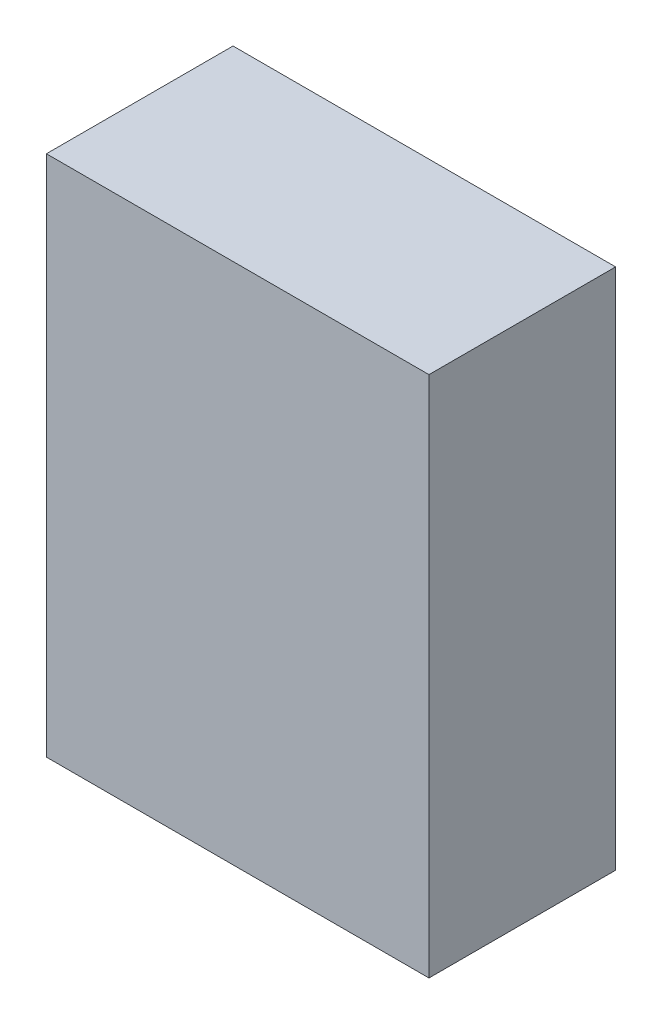
ISO-10303-21;
HEADER;
FILE_DESCRIPTION(('STEP AP214'),'2;1');
FILE_NAME('part.step','',(''),(''),'','','');
FILE_SCHEMA(('AUTOMOTIVE_DESIGN { 1 0 10303 214 1 1 1 1 }'));
ENDSEC;
DATA;
#1=APPLICATION_CONTEXT('core data for automotive mechanical design processes');
#2=APPLICATION_PROTOCOL_DEFINITION('international standard','automotive_design',2000,#1);
#3=PRODUCT_CONTEXT('',#1,'mechanical');
#4=PRODUCT('Part','Part','',(#3));
#5=PRODUCT_RELATED_PRODUCT_CATEGORY('part','',(#4));
#6=PRODUCT_DEFINITION_FORMATION('','',#4);
#7=PRODUCT_DEFINITION_CONTEXT('part definition',#1,'design');
#8=PRODUCT_DEFINITION('design','',#6,#7);
#9=PRODUCT_DEFINITION_SHAPE('','',#8);
#10=(LENGTH_UNIT() NAMED_UNIT(*) SI_UNIT(.MILLI.,.METRE.));
#11=(NAMED_UNIT(*) PLANE_ANGLE_UNIT() SI_UNIT($,.RADIAN.));
#12=(NAMED_UNIT(*) SI_UNIT($,.STERADIAN.) SOLID_ANGLE_UNIT());
#13=UNCERTAINTY_MEASURE_WITH_UNIT(LENGTH_MEASURE(1.E-05),#10,'distance_accuracy_value','');
#14=(GEOMETRIC_REPRESENTATION_CONTEXT(3) GLOBAL_UNCERTAINTY_ASSIGNED_CONTEXT((#13)) GLOBAL_UNIT_ASSIGNED_CONTEXT((#10,
#11,#12)) REPRESENTATION_CONTEXT('',''));
#15=CARTESIAN_POINT('',(0.,0.,0.));
#16=DIRECTION('',(0.,0.,1.));
#17=DIRECTION('',(1.,0.,0.));
#18=AXIS2_PLACEMENT_3D('',#15,#16,#17);
#19=CARTESIAN_POINT('',(0.,0.,0.2));
#20=DIRECTION('',(0.,0.,1.));
#21=DIRECTION('',(1.,0.,0.));
#22=AXIS2_PLACEMENT_3D('',#19,#20,#21);
#23=PLANE('',#22);
#24=DIRECTION('',(0.,-1.,0.));
#25=VECTOR('',#24,1.);
#26=CARTESIAN_POINT('',(0.43,-2.44,0.2));
#27=LINE('',#26,#25);
#28=CARTESIAN_POINT('',(0.43,-3.,0.2));
#29=VERTEX_POINT('',#28);
#30=CARTESIAN_POINT('',(0.43,-2.44,0.2));
#31=VERTEX_POINT('',#30);
#32=EDGE_CURVE('E68',#29,#31,#27,.F.);
#33=ORIENTED_EDGE('',*,*,#32,.F.);
#34=DIRECTION('',(1.,0.,0.));
#35=VECTOR('',#34,1.);
#36=CARTESIAN_POINT('',(0.43,-3.,0.2));
#37=LINE('',#36,#35);
#38=CARTESIAN_POINT('',(0.84,-3.,0.2));
#39=VERTEX_POINT('',#38);
#40=EDGE_CURVE('E20',#39,#29,#37,.F.);
#41=ORIENTED_EDGE('',*,*,#40,.F.);
#42=DIRECTION('',(0.,1.,0.));
#43=VECTOR('',#42,1.);
#44=CARTESIAN_POINT('',(0.84,-3.,0.2));
#45=LINE('',#44,#43);
#46=CARTESIAN_POINT('',(0.84,-2.44,0.2));
#47=VERTEX_POINT('',#46);
#48=EDGE_CURVE('E58',#47,#39,#45,.F.);
#49=ORIENTED_EDGE('',*,*,#48,.F.);
#50=DIRECTION('',(-1.,0.,0.));
#51=VECTOR('',#50,1.);
#52=CARTESIAN_POINT('',(0.84,-2.44,0.2));
#53=LINE('',#52,#51);
#54=EDGE_CURVE('E53',#31,#47,#53,.F.);
#55=ORIENTED_EDGE('',*,*,#54,.F.);
#56=EDGE_LOOP('',(#33,#41,#49,#55));
#57=FACE_BOUND('',#56,.T.);
#58=ADVANCED_FACE('F17',(#57),#23,.T.);
#59=CARTESIAN_POINT('',(0.43,-3.,0.));
#60=DIRECTION('',(0.,-1.,0.));
#61=DIRECTION('',(1.,0.,0.));
#62=AXIS2_PLACEMENT_3D('',#59,#60,#61);
#63=PLANE('',#62);
#64=DIRECTION('',(0.,0.,1.));
#65=VECTOR('',#64,1.);
#66=CARTESIAN_POINT('',(0.43,-3.,0.));
#67=LINE('',#66,#65);
#68=CARTESIAN_POINT('',(0.43,-3.,0.));
#69=VERTEX_POINT('',#68);
#70=EDGE_CURVE('E79',#69,#29,#67,.T.);
#71=ORIENTED_EDGE('',*,*,#70,.F.);
#72=DIRECTION('',(1.,0.,0.));
#73=VECTOR('',#72,1.);
#74=CARTESIAN_POINT('',(0.,-3.,0.));
#75=LINE('',#74,#73);
#76=CARTESIAN_POINT('',(0.84,-3.,0.));
#77=VERTEX_POINT('',#76);
#78=EDGE_CURVE('E74',#69,#77,#75,.T.);
#79=ORIENTED_EDGE('',*,*,#78,.T.);
#80=DIRECTION('',(0.,0.,1.));
#81=VECTOR('',#80,1.);
#82=CARTESIAN_POINT('',(0.84,-3.,0.));
#83=LINE('',#82,#81);
#84=EDGE_CURVE('E63',#39,#77,#83,.F.);
#85=ORIENTED_EDGE('',*,*,#84,.F.);
#86=ORIENTED_EDGE('',*,*,#40,.T.);
#87=EDGE_LOOP('',(#71,#79,#85,#86));
#88=FACE_BOUND('',#87,.T.);
#89=ADVANCED_FACE('F73',(#88),#63,.T.);
#90=CARTESIAN_POINT('',(0.84,-3.,0.));
#91=DIRECTION('',(1.,0.,0.));
#92=DIRECTION('',(0.,1.,0.));
#93=AXIS2_PLACEMENT_3D('',#90,#91,#92);
#94=PLANE('',#93);
#95=ORIENTED_EDGE('',*,*,#84,.T.);
#96=DIRECTION('',(0.,1.,0.));
#97=VECTOR('',#96,1.);
#98=CARTESIAN_POINT('',(0.84,0.,0.));
#99=LINE('',#98,#97);
#100=CARTESIAN_POINT('',(0.84,-2.44,0.));
#101=VERTEX_POINT('',#100);
#102=EDGE_CURVE('E84',#77,#101,#99,.T.);
#103=ORIENTED_EDGE('',*,*,#102,.T.);
#104=DIRECTION('',(0.,0.,1.));
#105=VECTOR('',#104,1.);
#106=CARTESIAN_POINT('',(0.84,-2.44,0.));
#107=LINE('',#106,#105);
#108=EDGE_CURVE('E65',#47,#101,#107,.F.);
#109=ORIENTED_EDGE('',*,*,#108,.F.);
#110=ORIENTED_EDGE('',*,*,#48,.T.);
#111=EDGE_LOOP('',(#95,#103,#109,#110));
#112=FACE_BOUND('',#111,.T.);
#113=ADVANCED_FACE('F60',(#112),#94,.T.);
#114=CARTESIAN_POINT('',(0.84,-2.44,0.));
#115=DIRECTION('',(0.,1.,0.));
#116=DIRECTION('',(-1.,0.,0.));
#117=AXIS2_PLACEMENT_3D('',#114,#115,#116);
#118=PLANE('',#117);
#119=ORIENTED_EDGE('',*,*,#108,.T.);
#120=DIRECTION('',(1.,0.,0.));
#121=VECTOR('',#120,1.);
#122=CARTESIAN_POINT('',(0.,-2.44,0.));
#123=LINE('',#122,#121);
#124=CARTESIAN_POINT('',(0.43,-2.44,0.));
#125=VERTEX_POINT('',#124);
#126=EDGE_CURVE('E26',#101,#125,#123,.F.);
#127=ORIENTED_EDGE('',*,*,#126,.T.);
#128=DIRECTION('',(0.,0.,1.));
#129=VECTOR('',#128,1.);
#130=CARTESIAN_POINT('',(0.43,-2.44,0.));
#131=LINE('',#130,#129);
#132=EDGE_CURVE('E34',#31,#125,#131,.F.);
#133=ORIENTED_EDGE('',*,*,#132,.F.);
#134=ORIENTED_EDGE('',*,*,#54,.T.);
#135=EDGE_LOOP('',(#119,#127,#133,#134));
#136=FACE_BOUND('',#135,.T.);
#137=ADVANCED_FACE('F88',(#136),#118,.T.);
#138=CARTESIAN_POINT('',(0.43,-2.44,0.));
#139=DIRECTION('',(-1.,0.,0.));
#140=DIRECTION('',(0.,-1.,0.));
#141=AXIS2_PLACEMENT_3D('',#138,#139,#140);
#142=PLANE('',#141);
#143=ORIENTED_EDGE('',*,*,#132,.T.);
#144=DIRECTION('',(0.,1.,0.));
#145=VECTOR('',#144,1.);
#146=CARTESIAN_POINT('',(0.43,0.,0.));
#147=LINE('',#146,#145);
#148=EDGE_CURVE('E11',#125,#69,#147,.F.);
#149=ORIENTED_EDGE('',*,*,#148,.T.);
#150=ORIENTED_EDGE('',*,*,#70,.T.);
#151=ORIENTED_EDGE('',*,*,#32,.T.);
#152=EDGE_LOOP('',(#143,#149,#150,#151));
#153=FACE_BOUND('',#152,.T.);
#154=ADVANCED_FACE('F91',(#153),#142,.T.);
#155=CARTESIAN_POINT('',(0.,0.,0.));
#156=DIRECTION('',(0.,0.,1.));
#157=DIRECTION('',(1.,0.,0.));
#158=AXIS2_PLACEMENT_3D('',#155,#156,#157);
#159=PLANE('',#158);
#160=ORIENTED_EDGE('',*,*,#126,.F.);
#161=ORIENTED_EDGE('',*,*,#102,.F.);
#162=ORIENTED_EDGE('',*,*,#78,.F.);
#163=ORIENTED_EDGE('',*,*,#148,.F.);
#164=EDGE_LOOP('',(#160,#161,#162,#163));
#165=FACE_BOUND('',#164,.T.);
#166=ADVANCED_FACE('F90',(#165),#159,.F.);
#167=CLOSED_SHELL('',(#58,#89,#113,#137,#154,#166));
#168=MANIFOLD_SOLID_BREP('B1',#167);
#169=ADVANCED_BREP_SHAPE_REPRESENTATION('',(#18,#168),#14);
#170=SHAPE_DEFINITION_REPRESENTATION(#9,#169);
ENDSEC;
END-ISO-10303-21;
